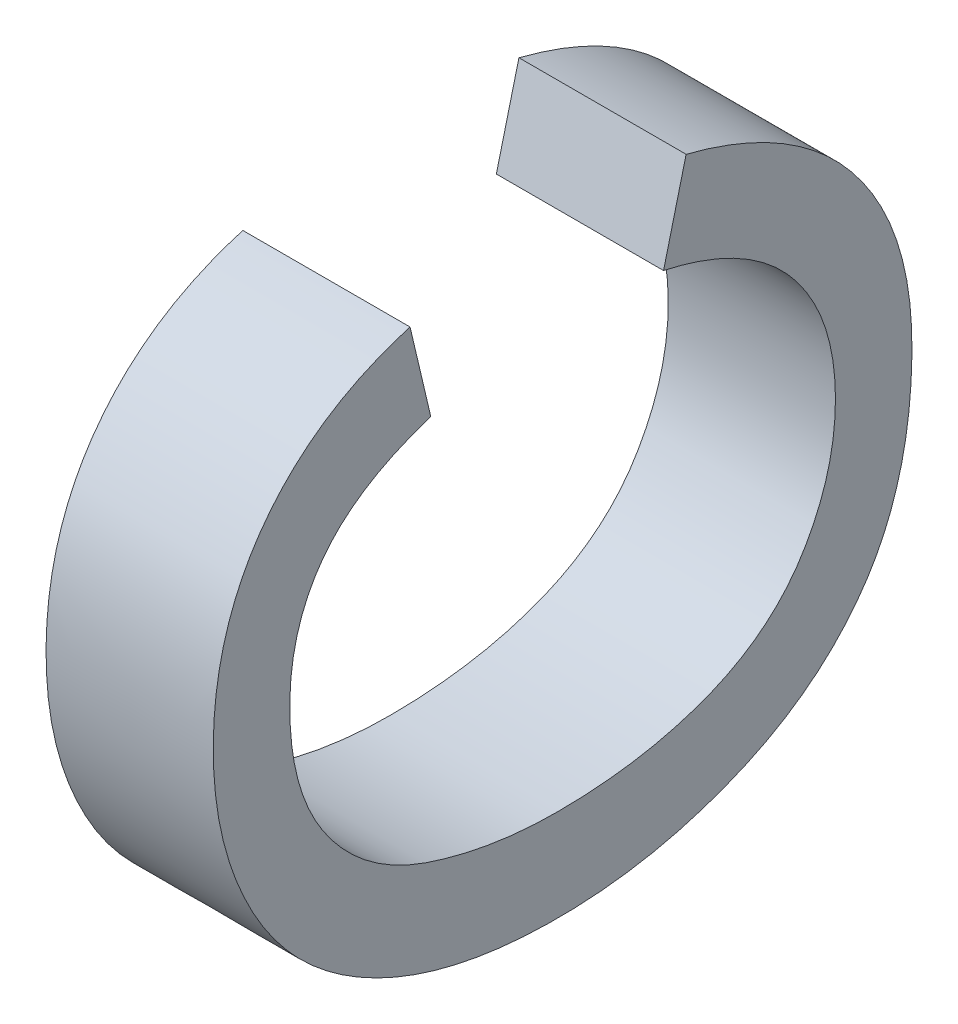
ISO-10303-21;
HEADER;
FILE_DESCRIPTION(('STEP AP214'),'2;1');
FILE_NAME('part.step','',(''),(''),'','','');
FILE_SCHEMA(('AUTOMOTIVE_DESIGN { 1 0 10303 214 1 1 1 1 }'));
ENDSEC;
DATA;
#1=APPLICATION_CONTEXT('core data for automotive mechanical design processes');
#2=APPLICATION_PROTOCOL_DEFINITION('international standard','automotive_design',2000,#1);
#3=PRODUCT_CONTEXT('',#1,'mechanical');
#4=PRODUCT('Part','Part','',(#3));
#5=PRODUCT_RELATED_PRODUCT_CATEGORY('part','',(#4));
#6=PRODUCT_DEFINITION_FORMATION('','',#4);
#7=PRODUCT_DEFINITION_CONTEXT('part definition',#1,'design');
#8=PRODUCT_DEFINITION('design','',#6,#7);
#9=PRODUCT_DEFINITION_SHAPE('','',#8);
#10=(LENGTH_UNIT() NAMED_UNIT(*) SI_UNIT(.MILLI.,.METRE.));
#11=(NAMED_UNIT(*) PLANE_ANGLE_UNIT() SI_UNIT($,.RADIAN.));
#12=(NAMED_UNIT(*) SI_UNIT($,.STERADIAN.) SOLID_ANGLE_UNIT());
#13=UNCERTAINTY_MEASURE_WITH_UNIT(LENGTH_MEASURE(1.E-05),#10,'distance_accuracy_value','');
#14=(GEOMETRIC_REPRESENTATION_CONTEXT(3) GLOBAL_UNCERTAINTY_ASSIGNED_CONTEXT((#13)) GLOBAL_UNIT_ASSIGNED_CONTEXT((#10,
#11,#12)) REPRESENTATION_CONTEXT('',''));
#15=CARTESIAN_POINT('',(0.,0.,0.));
#16=DIRECTION('',(0.,0.,1.));
#17=DIRECTION('',(1.,0.,0.));
#18=AXIS2_PLACEMENT_3D('',#15,#16,#17);
#19=CARTESIAN_POINT('',(4.55229940712911,-39.1353968574616,-8.69759037862996));
#20=DIRECTION('',(-1.,0.,0.));
#21=DIRECTION('',(0.,0.,1.));
#22=AXIS2_PLACEMENT_3D('',#19,#20,#21);
#23=PLANE('',#22);
#24=CARTESIAN_POINT('',(4.55229940712906,-38.8059830944942,-8.9188697190245));
#25=CARTESIAN_POINT('',(4.55229940712906,-38.8323080092035,-8.92507192406073));
#26=CARTESIAN_POINT('',(4.55229940712907,-38.8586329239128,-8.93127412909695));
#27=(BOUNDED_CURVE() B_SPLINE_CURVE(2,(#24,#25,#26),.UNSPECIFIED.,.F.,
.F.) B_SPLINE_CURVE_WITH_KNOTS((3,3),(43.,44.),
.UNSPECIFIED.) CURVE() GEOMETRIC_REPRESENTATION_ITEM() RATIONAL_B_SPLINE_CURVE((1.,1.,1.)) REPRESENTATION_ITEM(''));
#28=CARTESIAN_POINT('',(4.55229940712906,-38.8059830944942,-8.9188697190245));
#29=VERTEX_POINT('',#28);
#30=CARTESIAN_POINT('',(4.55229940712907,-38.8586329239128,-8.93127412909695));
#31=VERTEX_POINT('',#30);
#32=EDGE_CURVE('E96',#29,#31,#27,.T.);
#33=ORIENTED_EDGE('',*,*,#32,.T.);
#34=CARTESIAN_POINT('',(4.55229940712907,-38.8586329239128,-8.93127412909695));
#35=CARTESIAN_POINT('',(4.55229940712907,-38.8726912553283,-8.88716955995046));
#36=CARTESIAN_POINT('',(4.55229940712907,-38.8994296503733,-8.86704685027738));
#37=CARTESIAN_POINT('',(4.55229940712908,-38.9261680454184,-8.84692414060429));
#38=CARTESIAN_POINT('',(4.55229940712908,-38.9666891183217,-8.84692414060429));
#39=CARTESIAN_POINT('',(4.55229940712909,-39.0132745694827,-8.84692414060429));
#40=CARTESIAN_POINT('',(4.55229940712909,-39.044561248221,-8.86925207873471));
#41=CARTESIAN_POINT('',(4.5522994071291,-39.0758479269593,-8.89158001686511));
#42=CARTESIAN_POINT('',(4.5522994071291,-39.0885279905889,-8.92920672741821));
#43=CARTESIAN_POINT('',(4.5522994071291,-39.1012080542185,-8.9668334379713));
#44=CARTESIAN_POINT('',(4.5522994071291,-39.1012080542185,-9.00680320376031));
#45=CARTESIAN_POINT('',(4.5522994071291,-39.1012080542185,-9.05835041895027));
#46=CARTESIAN_POINT('',(4.55229940712909,-39.086184935353,-9.09680409017486));
#47=CARTESIAN_POINT('',(4.55229940712909,-39.0711618164875,-9.13525776139945));
#48=CARTESIAN_POINT('',(4.55229940712908,-39.0394616574134,-9.15427785684388));
#49=CARTESIAN_POINT('',(4.55229940712908,-39.0077614983394,-9.17329795228829));
#50=CARTESIAN_POINT('',(4.55229940712907,-38.9708239216792,-9.1732979522883));
#51=CARTESIAN_POINT('',(4.55229940712907,-38.9258923918612,-9.1732979522883));
#52=CARTESIAN_POINT('',(4.55229940712906,-38.8947435399015,-9.14738651791473));
#53=CARTESIAN_POINT('',(4.55229940712906,-38.8635947215909,-9.12147508354117));
#54=CARTESIAN_POINT('',(4.55229940712906,-38.8525685456552,-9.07047917546555));
#55=(BOUNDED_CURVE() B_SPLINE_CURVE(2,(#34,#35,#36,#37,#38,#39,#40,#41,#42,#43,#44,#45,#46,#47,
#48,#49,#50,#51,#52,#53,#54),.UNSPECIFIED.,.F.,.F.) B_SPLINE_CURVE_WITH_KNOTS((3,2,2,2,2,2,2,2,
2,2,3),(44.,45.,46.,47.,48.,49.,50.,51.,52.,53.,54.),
.UNSPECIFIED.) CURVE() GEOMETRIC_REPRESENTATION_ITEM() RATIONAL_B_SPLINE_CURVE((1.,1.,1.,1.,1.,
1.,1.,1.,1.,1.,1.,1.,1.,1.,1.,1.,1.,1.,1.,1.,1.)) REPRESENTATION_ITEM(''));
#56=CARTESIAN_POINT('',(4.55229940712906,-38.8525685456552,-9.07047917546555));
#57=VERTEX_POINT('',#56);
#58=EDGE_CURVE('E71',#31,#57,#55,.T.);
#59=ORIENTED_EDGE('',*,*,#58,.T.);
#60=CARTESIAN_POINT('',(4.55229940712906,-38.8525685456552,-9.07047917546555));
#61=CARTESIAN_POINT('',(4.55229940712906,-38.8258301506101,-9.0772326876161));
#62=CARTESIAN_POINT('',(4.55229940712905,-38.799091755565,-9.08398619976665));
#63=(BOUNDED_CURVE() B_SPLINE_CURVE(2,(#60,#61,#62),.UNSPECIFIED.,.F.,
.F.) B_SPLINE_CURVE_WITH_KNOTS((3,3),(54.,55.),
.UNSPECIFIED.) CURVE() GEOMETRIC_REPRESENTATION_ITEM() RATIONAL_B_SPLINE_CURVE((1.,1.,1.)) REPRESENTATION_ITEM(''));
#64=CARTESIAN_POINT('',(4.55229940712905,-38.799091755565,-9.08398619976665));
#65=VERTEX_POINT('',#64);
#66=EDGE_CURVE('E89',#57,#65,#63,.T.);
#67=ORIENTED_EDGE('',*,*,#66,.T.);
#68=CARTESIAN_POINT('',(4.55229940712905,-38.799091755565,-9.08398619976665));
#69=CARTESIAN_POINT('',(4.55229940712905,-38.8159066225521,-9.14986739992922));
#70=CARTESIAN_POINT('',(4.55229940712906,-38.8595977113629,-9.1844619213535));
#71=CARTESIAN_POINT('',(4.55229940712906,-38.9032888001736,-9.21905644277778));
#72=CARTESIAN_POINT('',(4.55229940712907,-38.9664134647645,-9.21905644277778));
#73=CARTESIAN_POINT('',(4.55229940712908,-39.0317433578128,-9.21905644277777));
#74=CARTESIAN_POINT('',(4.55229940712909,-39.0726779110519,-9.1924558745113));
#75=CARTESIAN_POINT('',(4.55229940712909,-39.1136124642909,-9.16585530624483));
#76=CARTESIAN_POINT('',(4.5522994071291,-39.1349756149713,-9.11541070528353));
#77=CARTESIAN_POINT('',(4.5522994071291,-39.1563387656516,-9.06496610432224));
#78=CARTESIAN_POINT('',(4.55229940712911,-39.1563387656516,-9.00707885731748));
#79=CARTESIAN_POINT('',(4.55229940712911,-39.1563387656516,-8.94395419272657));
#80=CARTESIAN_POINT('',(4.5522994071291,-39.1322190793996,-8.89695526122984));
#81=CARTESIAN_POINT('',(4.5522994071291,-39.1080993931476,-8.84995632973312));
#82=CARTESIAN_POINT('',(4.5522994071291,-39.0635813436654,-8.82556098992397));
#83=CARTESIAN_POINT('',(4.55229940712909,-39.0190632941832,-8.80116565011482));
#84=CARTESIAN_POINT('',(4.55229940712908,-38.9655865040931,-8.80116565011482));
#85=CARTESIAN_POINT('',(4.55229940712907,-38.9049427215166,-8.80116565011482));
#86=CARTESIAN_POINT('',(4.55229940712907,-38.8635946879418,-8.83203884851736));
#87=CARTESIAN_POINT('',(4.55229940712906,-38.8222466543669,-8.86291208056901));
#88=CARTESIAN_POINT('',(4.55229940712906,-38.8059830944942,-8.9188697190245));
#89=(BOUNDED_CURVE() B_SPLINE_CURVE(2,(#68,#69,#70,#71,#72,#73,#74,#75,#76,#77,#78,#79,#80,#81,
#82,#83,#84,#85,#86,#87,#88),.UNSPECIFIED.,.F.,.F.) B_SPLINE_CURVE_WITH_KNOTS((3,2,2,2,2,2,2,2,
2,2,3),(55.,56.,57.,58.,59.,60.,61.,62.,63.,64.,65.),
.UNSPECIFIED.) CURVE() GEOMETRIC_REPRESENTATION_ITEM() RATIONAL_B_SPLINE_CURVE((1.,1.,1.,1.,1.,
1.,1.,1.,1.,1.,1.,1.,1.,1.,1.,1.,1.,1.,1.,1.,1.)) REPRESENTATION_ITEM(''));
#90=EDGE_CURVE('E11',#65,#29,#89,.T.);
#91=ORIENTED_EDGE('',*,*,#90,.T.);
#92=EDGE_LOOP('',(#33,#59,#67,#91));
#93=FACE_BOUND('',#92,.T.);
#94=ADVANCED_FACE('F16',(#93),#23,.T.);
#95=CARTESIAN_POINT('',(4.65229940712911,-39.1353968574616,-8.69759037862997));
#96=DIRECTION('',(1.,0.,0.));
#97=DIRECTION('',(0.,1.,0.));
#98=AXIS2_PLACEMENT_3D('',#95,#96,#97);
#99=PLANE('',#98);
#100=CARTESIAN_POINT('',(4.65229940712905,-38.799091755565,-9.08398619976666));
#101=CARTESIAN_POINT('',(4.65229940712906,-38.8159066225521,-9.14986739992922));
#102=CARTESIAN_POINT('',(4.65229940712906,-38.8595977113629,-9.18446192135351));
#103=CARTESIAN_POINT('',(4.65229940712907,-38.9032888001736,-9.21905644277778));
#104=CARTESIAN_POINT('',(4.65229940712907,-38.9664134647645,-9.21905644277778));
#105=CARTESIAN_POINT('',(4.65229940712908,-39.0317433578128,-9.21905644277778));
#106=CARTESIAN_POINT('',(4.65229940712909,-39.0726779110518,-9.1924558745113));
#107=CARTESIAN_POINT('',(4.6522994071291,-39.1136124642909,-9.16585530624483));
#108=CARTESIAN_POINT('',(4.6522994071291,-39.1349756149712,-9.11541070528354));
#109=CARTESIAN_POINT('',(4.6522994071291,-39.1563387656516,-9.06496610432224));
#110=CARTESIAN_POINT('',(4.65229940712911,-39.1563387656516,-9.00707885731748));
#111=CARTESIAN_POINT('',(4.65229940712911,-39.1563387656516,-8.94395419272657));
#112=CARTESIAN_POINT('',(4.65229940712911,-39.1322190793996,-8.89695526122984));
#113=CARTESIAN_POINT('',(4.6522994071291,-39.1080993931476,-8.84995632973312));
#114=CARTESIAN_POINT('',(4.6522994071291,-39.0635813436654,-8.82556098992398));
#115=CARTESIAN_POINT('',(4.65229940712909,-39.0190632941831,-8.80116565011482));
#116=CARTESIAN_POINT('',(4.65229940712909,-38.965586504093,-8.80116565011482));
#117=CARTESIAN_POINT('',(4.65229940712908,-38.9049427215166,-8.80116565011482));
#118=CARTESIAN_POINT('',(4.65229940712907,-38.8635946879418,-8.83203884851736));
#119=CARTESIAN_POINT('',(4.65229940712906,-38.8222466543669,-8.86291208056901));
#120=CARTESIAN_POINT('',(4.65229940712906,-38.8059830944942,-8.9188697190245));
#121=(BOUNDED_CURVE() B_SPLINE_CURVE(2,(#100,#101,#102,#103,#104,#105,#106,#107,#108,#109,#110,
#111,#112,#113,#114,#115,#116,#117,#118,#119,#120),.UNSPECIFIED.,.F.,
.F.) B_SPLINE_CURVE_WITH_KNOTS((3,2,2,2,2,2,2,2,2,2,3),(55.,56.,57.,58.,59.,60.,61.,62.,63.,64.,
65.),.UNSPECIFIED.) CURVE() GEOMETRIC_REPRESENTATION_ITEM() RATIONAL_B_SPLINE_CURVE((1.,1.,1.,
1.,1.,1.,1.,1.,1.,1.,1.,1.,1.,1.,1.,1.,1.,1.,1.,1.,1.)) REPRESENTATION_ITEM(''));
#122=CARTESIAN_POINT('',(4.65229940712905,-38.799091755565,-9.08398619976666));
#123=VERTEX_POINT('',#122);
#124=CARTESIAN_POINT('',(4.65229940712906,-38.8059830944942,-8.9188697190245));
#125=VERTEX_POINT('',#124);
#126=EDGE_CURVE('E27',#123,#125,#121,.T.);
#127=ORIENTED_EDGE('',*,*,#126,.F.);
#128=CARTESIAN_POINT('',(4.65229940712906,-38.8525685456552,-9.07047917546555));
#129=CARTESIAN_POINT('',(4.65229940712906,-38.8258301506101,-9.07723268761611));
#130=CARTESIAN_POINT('',(4.65229940712905,-38.799091755565,-9.08398619976666));
#131=(BOUNDED_CURVE() B_SPLINE_CURVE(2,(#128,#129,#130),.UNSPECIFIED.,.F.,
.F.) B_SPLINE_CURVE_WITH_KNOTS((3,3),(54.,55.),
.UNSPECIFIED.) CURVE() GEOMETRIC_REPRESENTATION_ITEM() RATIONAL_B_SPLINE_CURVE((1.,1.,1.)) REPRESENTATION_ITEM(''));
#132=CARTESIAN_POINT('',(4.65229940712906,-38.8525685456552,-9.07047917546555));
#133=VERTEX_POINT('',#132);
#134=EDGE_CURVE('E57',#133,#123,#131,.T.);
#135=ORIENTED_EDGE('',*,*,#134,.F.);
#136=CARTESIAN_POINT('',(4.65229940712907,-38.8586329239128,-8.93127412909695));
#137=CARTESIAN_POINT('',(4.65229940712907,-38.8726912553282,-8.88716955995046));
#138=CARTESIAN_POINT('',(4.65229940712907,-38.8994296503733,-8.86704685027738));
#139=CARTESIAN_POINT('',(4.65229940712908,-38.9261680454184,-8.84692414060429));
#140=CARTESIAN_POINT('',(4.65229940712908,-38.9666891183217,-8.8469241406043));
#141=CARTESIAN_POINT('',(4.65229940712909,-39.0132745694827,-8.8469241406043));
#142=CARTESIAN_POINT('',(4.65229940712909,-39.044561248221,-8.86925207873471));
#143=CARTESIAN_POINT('',(4.6522994071291,-39.0758479269593,-8.89158001686511));
#144=CARTESIAN_POINT('',(4.6522994071291,-39.0885279905889,-8.92920672741821));
#145=CARTESIAN_POINT('',(4.6522994071291,-39.1012080542185,-8.9668334379713));
#146=CARTESIAN_POINT('',(4.6522994071291,-39.1012080542185,-9.00680320376031));
#147=CARTESIAN_POINT('',(4.6522994071291,-39.1012080542185,-9.05835041895027));
#148=CARTESIAN_POINT('',(4.65229940712909,-39.086184935353,-9.09680409017486));
#149=CARTESIAN_POINT('',(4.65229940712909,-39.0711618164874,-9.13525776139945));
#150=CARTESIAN_POINT('',(4.65229940712909,-39.0394616574134,-9.15427785684388));
#151=CARTESIAN_POINT('',(4.65229940712908,-39.0077614983394,-9.17329795228829));
#152=CARTESIAN_POINT('',(4.65229940712908,-38.9708239216792,-9.1732979522883));
#153=CARTESIAN_POINT('',(4.65229940712907,-38.9258923918612,-9.1732979522883));
#154=CARTESIAN_POINT('',(4.65229940712907,-38.8947435399015,-9.14738651791474));
#155=CARTESIAN_POINT('',(4.65229940712906,-38.8635947215909,-9.12147508354117));
#156=CARTESIAN_POINT('',(4.65229940712906,-38.8525685456552,-9.07047917546555));
#157=(BOUNDED_CURVE() B_SPLINE_CURVE(2,(#136,#137,#138,#139,#140,#141,#142,#143,#144,#145,#146,
#147,#148,#149,#150,#151,#152,#153,#154,#155,#156),.UNSPECIFIED.,.F.,
.F.) B_SPLINE_CURVE_WITH_KNOTS((3,2,2,2,2,2,2,2,2,2,3),(44.,45.,46.,47.,48.,49.,50.,51.,52.,53.,
54.),.UNSPECIFIED.) CURVE() GEOMETRIC_REPRESENTATION_ITEM() RATIONAL_B_SPLINE_CURVE((1.,1.,1.,
1.,1.,1.,1.,1.,1.,1.,1.,1.,1.,1.,1.,1.,1.,1.,1.,1.,1.)) REPRESENTATION_ITEM(''));
#158=CARTESIAN_POINT('',(4.65229940712907,-38.8586329239128,-8.93127412909695));
#159=VERTEX_POINT('',#158);
#160=EDGE_CURVE('E78',#159,#133,#157,.T.);
#161=ORIENTED_EDGE('',*,*,#160,.F.);
#162=CARTESIAN_POINT('',(4.65229940712906,-38.8059830944942,-8.9188697190245));
#163=CARTESIAN_POINT('',(4.65229940712906,-38.8323080092035,-8.92507192406073));
#164=CARTESIAN_POINT('',(4.65229940712907,-38.8586329239128,-8.93127412909695));
#165=(BOUNDED_CURVE() B_SPLINE_CURVE(2,(#162,#163,#164),.UNSPECIFIED.,.F.,
.F.) B_SPLINE_CURVE_WITH_KNOTS((3,3),(43.,44.),
.UNSPECIFIED.) CURVE() GEOMETRIC_REPRESENTATION_ITEM() RATIONAL_B_SPLINE_CURVE((1.,1.,1.)) REPRESENTATION_ITEM(''));
#166=EDGE_CURVE('E95',#125,#159,#165,.T.);
#167=ORIENTED_EDGE('',*,*,#166,.F.);
#168=EDGE_LOOP('',(#127,#135,#161,#167));
#169=FACE_BOUND('',#168,.T.);
#170=ADVANCED_FACE('F99',(#169),#99,.T.);
#171=CARTESIAN_POINT('',(4.65229940712905,-38.799091755565,-9.08398619976666));
#172=CARTESIAN_POINT('',(4.55229940712905,-38.799091755565,-9.08398619976665));
#173=CARTESIAN_POINT('',(4.65229940712906,-38.8159066225521,-9.14986739992922));
#174=CARTESIAN_POINT('',(4.55229940712905,-38.8159066225521,-9.14986739992922));
#175=CARTESIAN_POINT('',(4.65229940712906,-38.8595977113629,-9.18446192135351));
#176=CARTESIAN_POINT('',(4.55229940712906,-38.8595977113629,-9.1844619213535));
#177=CARTESIAN_POINT('',(4.65229940712907,-38.9032888001736,-9.21905644277778));
#178=CARTESIAN_POINT('',(4.55229940712906,-38.9032888001736,-9.21905644277778));
#179=CARTESIAN_POINT('',(4.65229940712907,-38.9664134647645,-9.21905644277778));
#180=CARTESIAN_POINT('',(4.55229940712907,-38.9664134647645,-9.21905644277778));
#181=CARTESIAN_POINT('',(4.65229940712908,-39.0317433578128,-9.21905644277778));
#182=CARTESIAN_POINT('',(4.55229940712908,-39.0317433578128,-9.21905644277777));
#183=CARTESIAN_POINT('',(4.65229940712909,-39.0726779110518,-9.1924558745113));
#184=CARTESIAN_POINT('',(4.55229940712909,-39.0726779110519,-9.1924558745113));
#185=CARTESIAN_POINT('',(4.6522994071291,-39.1136124642909,-9.16585530624483));
#186=CARTESIAN_POINT('',(4.55229940712909,-39.1136124642909,-9.16585530624483));
#187=CARTESIAN_POINT('',(4.6522994071291,-39.1349756149712,-9.11541070528354));
#188=CARTESIAN_POINT('',(4.5522994071291,-39.1349756149713,-9.11541070528353));
#189=CARTESIAN_POINT('',(4.6522994071291,-39.1563387656516,-9.06496610432224));
#190=CARTESIAN_POINT('',(4.5522994071291,-39.1563387656516,-9.06496610432224));
#191=CARTESIAN_POINT('',(4.65229940712911,-39.1563387656516,-9.00707885731748));
#192=CARTESIAN_POINT('',(4.55229940712911,-39.1563387656516,-9.00707885731748));
#193=CARTESIAN_POINT('',(4.65229940712911,-39.1563387656516,-8.94395419272657));
#194=CARTESIAN_POINT('',(4.55229940712911,-39.1563387656516,-8.94395419272657));
#195=CARTESIAN_POINT('',(4.65229940712911,-39.1322190793996,-8.89695526122984));
#196=CARTESIAN_POINT('',(4.5522994071291,-39.1322190793996,-8.89695526122984));
#197=CARTESIAN_POINT('',(4.6522994071291,-39.1080993931476,-8.84995632973312));
#198=CARTESIAN_POINT('',(4.5522994071291,-39.1080993931476,-8.84995632973312));
#199=CARTESIAN_POINT('',(4.6522994071291,-39.0635813436654,-8.82556098992398));
#200=CARTESIAN_POINT('',(4.5522994071291,-39.0635813436654,-8.82556098992397));
#201=CARTESIAN_POINT('',(4.65229940712909,-39.0190632941831,-8.80116565011482));
#202=CARTESIAN_POINT('',(4.55229940712909,-39.0190632941832,-8.80116565011482));
#203=CARTESIAN_POINT('',(4.65229940712909,-38.965586504093,-8.80116565011482));
#204=CARTESIAN_POINT('',(4.55229940712908,-38.9655865040931,-8.80116565011482));
#205=CARTESIAN_POINT('',(4.65229940712908,-38.9049427215166,-8.80116565011482));
#206=CARTESIAN_POINT('',(4.55229940712907,-38.9049427215166,-8.80116565011482));
#207=CARTESIAN_POINT('',(4.65229940712907,-38.8635946879418,-8.83203884851736));
#208=CARTESIAN_POINT('',(4.55229940712907,-38.8635946879418,-8.83203884851736));
#209=CARTESIAN_POINT('',(4.65229940712906,-38.8222466543669,-8.86291208056901));
#210=CARTESIAN_POINT('',(4.55229940712906,-38.8222466543669,-8.86291208056901));
#211=CARTESIAN_POINT('',(4.65229940712906,-38.8059830944942,-8.9188697190245));
#212=CARTESIAN_POINT('',(4.55229940712906,-38.8059830944942,-8.9188697190245));
#213=(BOUNDED_SURFACE() B_SPLINE_SURFACE(2,1,((#171,#172),(#173,#174),(#175,#176),(#177,#178),
(#179,#180),(#181,#182),(#183,#184),(#185,#186),(#187,#188),(#189,#190),(#191,#192),(#193,#194),
(#195,#196),(#197,#198),(#199,#200),(#201,#202),(#203,#204),(#205,#206),(#207,#208),(#209,#210),
(#211,#212)),.UNSPECIFIED.,.F.,.F.,.F.) B_SPLINE_SURFACE_WITH_KNOTS((3,2,2,2,2,2,2,2,2,2,3),(2,
2),(55.,56.,57.,58.,59.,60.,61.,62.,63.,64.,65.),(0.,0.1),
.UNSPECIFIED.) GEOMETRIC_REPRESENTATION_ITEM() RATIONAL_B_SPLINE_SURFACE(((1.,1.),(1.,1.),(1.,
1.),(1.,1.),(1.,1.),(1.,1.),(1.,1.),(1.,1.),(1.,1.),(1.,1.),(1.,1.),(1.,1.),(1.,1.),(1.,1.),(1.,
1.),(1.,1.),(1.,1.),(1.,1.),(1.,1.),(1.,1.),(1.,1.))) REPRESENTATION_ITEM('') SURFACE());
#214=CARTESIAN_POINT('',(4.65229940712906,-38.8059830944942,-8.9188697190245));
#215=CARTESIAN_POINT('',(4.55229940712906,-38.8059830944942,-8.9188697190245));
#216=(BOUNDED_CURVE() B_SPLINE_CURVE(1,(#214,#215),.UNSPECIFIED.,.F.,
.F.) B_SPLINE_CURVE_WITH_KNOTS((2,2),(0.,0.1),
.UNSPECIFIED.) CURVE() GEOMETRIC_REPRESENTATION_ITEM() RATIONAL_B_SPLINE_CURVE((1.,1.)) REPRESENTATION_ITEM(''));
#217=EDGE_CURVE('E84',#125,#29,#216,.T.);
#218=CARTESIAN_POINT('',(4.65229940712905,-38.799091755565,-9.08398619976666));
#219=CARTESIAN_POINT('',(4.55229940712905,-38.799091755565,-9.08398619976665));
#220=(BOUNDED_CURVE() B_SPLINE_CURVE(1,(#218,#219),.UNSPECIFIED.,.F.,
.F.) B_SPLINE_CURVE_WITH_KNOTS((2,2),(0.,0.1),
.UNSPECIFIED.) CURVE() GEOMETRIC_REPRESENTATION_ITEM() RATIONAL_B_SPLINE_CURVE((1.,1.)) REPRESENTATION_ITEM(''));
#221=EDGE_CURVE('E87',#123,#65,#220,.T.);
#222=ORIENTED_EDGE('',*,*,#126,.T.);
#223=ORIENTED_EDGE('',*,*,#217,.T.);
#224=ORIENTED_EDGE('',*,*,#90,.F.);
#225=ORIENTED_EDGE('',*,*,#221,.F.);
#226=EDGE_LOOP('',(#222,#223,#224,#225));
#227=FACE_BOUND('',#226,.T.);
#228=ADVANCED_FACE('F83',(#227),#213,.T.);
#229=CARTESIAN_POINT('',(4.65229940712906,-38.8525685456552,-9.07047917546555));
#230=CARTESIAN_POINT('',(4.55229940712906,-38.8525685456552,-9.07047917546555));
#231=CARTESIAN_POINT('',(4.65229940712906,-38.8258301506101,-9.07723268761611));
#232=CARTESIAN_POINT('',(4.55229940712906,-38.8258301506101,-9.0772326876161));
#233=CARTESIAN_POINT('',(4.65229940712905,-38.799091755565,-9.08398619976666));
#234=CARTESIAN_POINT('',(4.55229940712905,-38.799091755565,-9.08398619976665));
#235=(BOUNDED_SURFACE() B_SPLINE_SURFACE(2,1,((#229,#230),(#231,#232),(#233,#234)),
.UNSPECIFIED.,.F.,.F.,.F.) B_SPLINE_SURFACE_WITH_KNOTS((3,3),(2,2),(54.,55.),(0.,0.1),
.UNSPECIFIED.) GEOMETRIC_REPRESENTATION_ITEM() RATIONAL_B_SPLINE_SURFACE(((1.,1.),(1.,1.),(1.,1.))) REPRESENTATION_ITEM('') SURFACE());
#236=CARTESIAN_POINT('',(4.65229940712906,-38.8525685456552,-9.07047917546555));
#237=CARTESIAN_POINT('',(4.55229940712906,-38.8525685456552,-9.07047917546555));
#238=(BOUNDED_CURVE() B_SPLINE_CURVE(1,(#236,#237),.UNSPECIFIED.,.F.,
.F.) B_SPLINE_CURVE_WITH_KNOTS((2,2),(0.,0.1),
.UNSPECIFIED.) CURVE() GEOMETRIC_REPRESENTATION_ITEM() RATIONAL_B_SPLINE_CURVE((1.,1.)) REPRESENTATION_ITEM(''));
#239=EDGE_CURVE('E118',#133,#57,#238,.T.);
#240=ORIENTED_EDGE('',*,*,#134,.T.);
#241=ORIENTED_EDGE('',*,*,#221,.T.);
#242=ORIENTED_EDGE('',*,*,#66,.F.);
#243=ORIENTED_EDGE('',*,*,#239,.F.);
#244=EDGE_LOOP('',(#240,#241,#242,#243));
#245=FACE_BOUND('',#244,.T.);
#246=ADVANCED_FACE('F177',(#245),#235,.T.);
#247=CARTESIAN_POINT('',(4.65229940712907,-38.8586329239128,-8.93127412909695));
#248=CARTESIAN_POINT('',(4.55229940712907,-38.8586329239128,-8.93127412909695));
#249=CARTESIAN_POINT('',(4.65229940712907,-38.8726912553282,-8.88716955995046));
#250=CARTESIAN_POINT('',(4.55229940712907,-38.8726912553283,-8.88716955995046));
#251=CARTESIAN_POINT('',(4.65229940712907,-38.8994296503733,-8.86704685027738));
#252=CARTESIAN_POINT('',(4.55229940712907,-38.8994296503733,-8.86704685027738));
#253=CARTESIAN_POINT('',(4.65229940712908,-38.9261680454184,-8.84692414060429));
#254=CARTESIAN_POINT('',(4.55229940712908,-38.9261680454184,-8.84692414060429));
#255=CARTESIAN_POINT('',(4.65229940712908,-38.9666891183217,-8.8469241406043));
#256=CARTESIAN_POINT('',(4.55229940712908,-38.9666891183217,-8.84692414060429));
#257=CARTESIAN_POINT('',(4.65229940712909,-39.0132745694827,-8.8469241406043));
#258=CARTESIAN_POINT('',(4.55229940712909,-39.0132745694827,-8.84692414060429));
#259=CARTESIAN_POINT('',(4.65229940712909,-39.044561248221,-8.86925207873471));
#260=CARTESIAN_POINT('',(4.55229940712909,-39.044561248221,-8.86925207873471));
#261=CARTESIAN_POINT('',(4.6522994071291,-39.0758479269593,-8.89158001686511));
#262=CARTESIAN_POINT('',(4.5522994071291,-39.0758479269593,-8.89158001686511));
#263=CARTESIAN_POINT('',(4.6522994071291,-39.0885279905889,-8.92920672741821));
#264=CARTESIAN_POINT('',(4.5522994071291,-39.0885279905889,-8.92920672741821));
#265=CARTESIAN_POINT('',(4.6522994071291,-39.1012080542185,-8.9668334379713));
#266=CARTESIAN_POINT('',(4.5522994071291,-39.1012080542185,-8.9668334379713));
#267=CARTESIAN_POINT('',(4.6522994071291,-39.1012080542185,-9.00680320376031));
#268=CARTESIAN_POINT('',(4.5522994071291,-39.1012080542185,-9.00680320376031));
#269=CARTESIAN_POINT('',(4.6522994071291,-39.1012080542185,-9.05835041895027));
#270=CARTESIAN_POINT('',(4.5522994071291,-39.1012080542185,-9.05835041895027));
#271=CARTESIAN_POINT('',(4.65229940712909,-39.086184935353,-9.09680409017486));
#272=CARTESIAN_POINT('',(4.55229940712909,-39.086184935353,-9.09680409017486));
#273=CARTESIAN_POINT('',(4.65229940712909,-39.0711618164874,-9.13525776139945));
#274=CARTESIAN_POINT('',(4.55229940712909,-39.0711618164875,-9.13525776139945));
#275=CARTESIAN_POINT('',(4.65229940712909,-39.0394616574134,-9.15427785684388));
#276=CARTESIAN_POINT('',(4.55229940712908,-39.0394616574134,-9.15427785684388));
#277=CARTESIAN_POINT('',(4.65229940712908,-39.0077614983394,-9.17329795228829));
#278=CARTESIAN_POINT('',(4.55229940712908,-39.0077614983394,-9.17329795228829));
#279=CARTESIAN_POINT('',(4.65229940712908,-38.9708239216792,-9.1732979522883));
#280=CARTESIAN_POINT('',(4.55229940712907,-38.9708239216792,-9.1732979522883));
#281=CARTESIAN_POINT('',(4.65229940712907,-38.9258923918612,-9.1732979522883));
#282=CARTESIAN_POINT('',(4.55229940712907,-38.9258923918612,-9.1732979522883));
#283=CARTESIAN_POINT('',(4.65229940712907,-38.8947435399015,-9.14738651791474));
#284=CARTESIAN_POINT('',(4.55229940712906,-38.8947435399015,-9.14738651791473));
#285=CARTESIAN_POINT('',(4.65229940712906,-38.8635947215909,-9.12147508354117));
#286=CARTESIAN_POINT('',(4.55229940712906,-38.8635947215909,-9.12147508354117));
#287=CARTESIAN_POINT('',(4.65229940712906,-38.8525685456552,-9.07047917546555));
#288=CARTESIAN_POINT('',(4.55229940712906,-38.8525685456552,-9.07047917546555));
#289=(BOUNDED_SURFACE() B_SPLINE_SURFACE(2,1,((#247,#248),(#249,#250),(#251,#252),(#253,#254),
(#255,#256),(#257,#258),(#259,#260),(#261,#262),(#263,#264),(#265,#266),(#267,#268),(#269,#270),
(#271,#272),(#273,#274),(#275,#276),(#277,#278),(#279,#280),(#281,#282),(#283,#284),(#285,#286),
(#287,#288)),.UNSPECIFIED.,.F.,.F.,.F.) B_SPLINE_SURFACE_WITH_KNOTS((3,2,2,2,2,2,2,2,2,2,3),(2,
2),(44.,45.,46.,47.,48.,49.,50.,51.,52.,53.,54.),(0.,0.1),
.UNSPECIFIED.) GEOMETRIC_REPRESENTATION_ITEM() RATIONAL_B_SPLINE_SURFACE(((1.,1.),(1.,1.),(1.,
1.),(1.,1.),(1.,1.),(1.,1.),(1.,1.),(1.,1.),(1.,1.),(1.,1.),(1.,1.),(1.,1.),(1.,1.),(1.,1.),(1.,
1.),(1.,1.),(1.,1.),(1.,1.),(1.,1.),(1.,1.),(1.,1.))) REPRESENTATION_ITEM('') SURFACE());
#290=CARTESIAN_POINT('',(4.65229940712907,-38.8586329239128,-8.93127412909695));
#291=CARTESIAN_POINT('',(4.55229940712907,-38.8586329239128,-8.93127412909695));
#292=(BOUNDED_CURVE() B_SPLINE_CURVE(1,(#290,#291),.UNSPECIFIED.,.F.,
.F.) B_SPLINE_CURVE_WITH_KNOTS((2,2),(0.,0.1),
.UNSPECIFIED.) CURVE() GEOMETRIC_REPRESENTATION_ITEM() RATIONAL_B_SPLINE_CURVE((1.,1.)) REPRESENTATION_ITEM(''));
#293=EDGE_CURVE('E101',#159,#31,#292,.T.);
#294=ORIENTED_EDGE('',*,*,#160,.T.);
#295=ORIENTED_EDGE('',*,*,#239,.T.);
#296=ORIENTED_EDGE('',*,*,#58,.F.);
#297=ORIENTED_EDGE('',*,*,#293,.F.);
#298=EDGE_LOOP('',(#294,#295,#296,#297));
#299=FACE_BOUND('',#298,.T.);
#300=ADVANCED_FACE('F175',(#299),#289,.T.);
#301=CARTESIAN_POINT('',(4.65229940712906,-38.8059830944942,-8.9188697190245));
#302=CARTESIAN_POINT('',(4.55229940712906,-38.8059830944942,-8.9188697190245));
#303=CARTESIAN_POINT('',(4.65229940712906,-38.8323080092035,-8.92507192406073));
#304=CARTESIAN_POINT('',(4.55229940712906,-38.8323080092035,-8.92507192406073));
#305=CARTESIAN_POINT('',(4.65229940712907,-38.8586329239128,-8.93127412909695));
#306=CARTESIAN_POINT('',(4.55229940712907,-38.8586329239128,-8.93127412909695));
#307=(BOUNDED_SURFACE() B_SPLINE_SURFACE(2,1,((#301,#302),(#303,#304),(#305,#306)),
.UNSPECIFIED.,.F.,.F.,.F.) B_SPLINE_SURFACE_WITH_KNOTS((3,3),(2,2),(43.,44.),(0.,0.1),
.UNSPECIFIED.) GEOMETRIC_REPRESENTATION_ITEM() RATIONAL_B_SPLINE_SURFACE(((1.,1.),(1.,1.),(1.,1.))) REPRESENTATION_ITEM('') SURFACE());
#308=ORIENTED_EDGE('',*,*,#166,.T.);
#309=ORIENTED_EDGE('',*,*,#293,.T.);
#310=ORIENTED_EDGE('',*,*,#32,.F.);
#311=ORIENTED_EDGE('',*,*,#217,.F.);
#312=EDGE_LOOP('',(#308,#309,#310,#311));
#313=FACE_BOUND('',#312,.T.);
#314=ADVANCED_FACE('F93',(#313),#307,.T.);
#315=CLOSED_SHELL('',(#94,#170,#228,#246,#300,#314));
#316=MANIFOLD_SOLID_BREP('B1',#315);
#317=ADVANCED_BREP_SHAPE_REPRESENTATION('',(#18,#316),#14);
#318=SHAPE_DEFINITION_REPRESENTATION(#9,#317);
ENDSEC;
END-ISO-10303-21;
